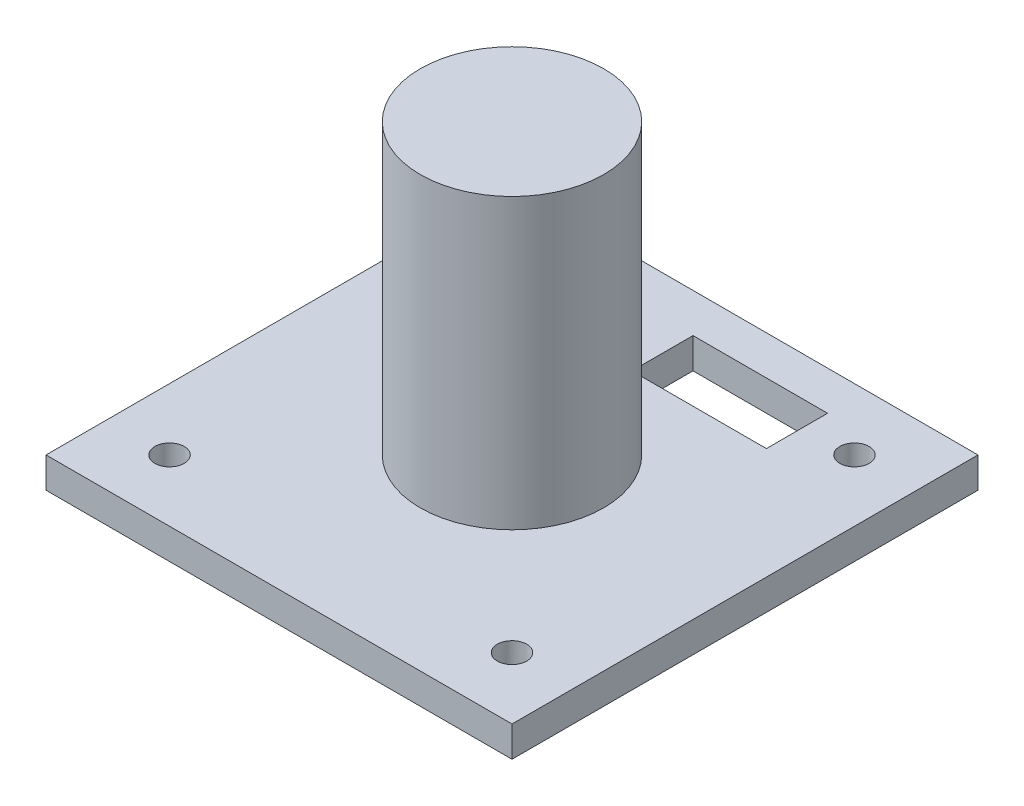
ISO-10303-21;
HEADER;
FILE_DESCRIPTION(('STEP AP214'),'2;1');
FILE_NAME('part.step','',(''),(''),'','','');
FILE_SCHEMA(('AUTOMOTIVE_DESIGN { 1 0 10303 214 1 1 1 1 }'));
ENDSEC;
DATA;
#1=APPLICATION_CONTEXT('core data for automotive mechanical design processes');
#2=APPLICATION_PROTOCOL_DEFINITION('international standard','automotive_design',2000,#1);
#3=PRODUCT_CONTEXT('',#1,'mechanical');
#4=PRODUCT('Part','Part','',(#3));
#5=PRODUCT_RELATED_PRODUCT_CATEGORY('part','',(#4));
#6=PRODUCT_DEFINITION_FORMATION('','',#4);
#7=PRODUCT_DEFINITION_CONTEXT('part definition',#1,'design');
#8=PRODUCT_DEFINITION('design','',#6,#7);
#9=PRODUCT_DEFINITION_SHAPE('','',#8);
#10=(LENGTH_UNIT() NAMED_UNIT(*) SI_UNIT(.MILLI.,.METRE.));
#11=(NAMED_UNIT(*) PLANE_ANGLE_UNIT() SI_UNIT($,.RADIAN.));
#12=(NAMED_UNIT(*) SI_UNIT($,.STERADIAN.) SOLID_ANGLE_UNIT());
#13=UNCERTAINTY_MEASURE_WITH_UNIT(LENGTH_MEASURE(1.E-05),#10,'distance_accuracy_value','');
#14=(GEOMETRIC_REPRESENTATION_CONTEXT(3) GLOBAL_UNCERTAINTY_ASSIGNED_CONTEXT((#13)) GLOBAL_UNIT_ASSIGNED_CONTEXT((#10,
#11,#12)) REPRESENTATION_CONTEXT('',''));
#15=CARTESIAN_POINT('',(0.,0.,0.));
#16=DIRECTION('',(0.,0.,1.));
#17=DIRECTION('',(1.,0.,0.));
#18=AXIS2_PLACEMENT_3D('',#15,#16,#17);
#19=CARTESIAN_POINT('',(0.,2.5,-10.85));
#20=DIRECTION('',(0.,0.,1.));
#21=DIRECTION('',(1.,0.,0.));
#22=AXIS2_PLACEMENT_3D('',#19,#20,#21);
#23=PLANE('',#22);
#24=DIRECTION('',(-1.,0.,0.));
#25=VECTOR('',#24,1.);
#26=CARTESIAN_POINT('',(0.,0.,-10.85));
#27=LINE('',#26,#25);
#28=CARTESIAN_POINT('',(9.95,0.,-10.85));
#29=VERTEX_POINT('',#28);
#30=CARTESIAN_POINT('',(-1.05,0.,-10.85));
#31=VERTEX_POINT('',#30);
#32=EDGE_CURVE('E178',#29,#31,#27,.T.);
#33=ORIENTED_EDGE('',*,*,#32,.T.);
#34=DIRECTION('',(0.,-1.,0.));
#35=VECTOR('',#34,1.);
#36=CARTESIAN_POINT('',(-1.05,2.5,-10.85));
#37=LINE('',#36,#35);
#38=CARTESIAN_POINT('',(-1.05,2.5,-10.85));
#39=VERTEX_POINT('',#38);
#40=EDGE_CURVE('E11',#39,#31,#37,.T.);
#41=ORIENTED_EDGE('',*,*,#40,.F.);
#42=DIRECTION('',(-1.,0.,0.));
#43=VECTOR('',#42,1.);
#44=CARTESIAN_POINT('',(0.,2.5,-10.85));
#45=LINE('',#44,#43);
#46=CARTESIAN_POINT('',(9.95,2.5,-10.85));
#47=VERTEX_POINT('',#46);
#48=EDGE_CURVE('E130',#47,#39,#45,.T.);
#49=ORIENTED_EDGE('',*,*,#48,.F.);
#50=DIRECTION('',(0.,-1.,0.));
#51=VECTOR('',#50,1.);
#52=CARTESIAN_POINT('',(9.95,2.5,-10.85));
#53=LINE('',#52,#51);
#54=EDGE_CURVE('E189',#47,#29,#53,.T.);
#55=ORIENTED_EDGE('',*,*,#54,.T.);
#56=EDGE_LOOP('',(#33,#41,#49,#55));
#57=FACE_BOUND('',#56,.T.);
#58=ADVANCED_FACE('F47',(#57),#23,.F.);
#59=CARTESIAN_POINT('',(-1.05,2.5,0.));
#60=DIRECTION('',(-1.,0.,0.));
#61=DIRECTION('',(0.,0.,1.));
#62=AXIS2_PLACEMENT_3D('',#59,#60,#61);
#63=PLANE('',#62);
#64=DIRECTION('',(0.,0.,-1.));
#65=VECTOR('',#64,1.);
#66=CARTESIAN_POINT('',(-1.05,0.,0.));
#67=LINE('',#66,#65);
#68=CARTESIAN_POINT('',(-1.05,0.,-15.85));
#69=VERTEX_POINT('',#68);
#70=EDGE_CURVE('E136',#31,#69,#67,.T.);
#71=ORIENTED_EDGE('',*,*,#70,.T.);
#72=DIRECTION('',(0.,-1.,0.));
#73=VECTOR('',#72,1.);
#74=CARTESIAN_POINT('',(-1.05,2.5,-15.85));
#75=LINE('',#74,#73);
#76=CARTESIAN_POINT('',(-1.05,2.5,-15.85));
#77=VERTEX_POINT('',#76);
#78=EDGE_CURVE('E58',#77,#69,#75,.T.);
#79=ORIENTED_EDGE('',*,*,#78,.F.);
#80=DIRECTION('',(0.,0.,-1.));
#81=VECTOR('',#80,1.);
#82=CARTESIAN_POINT('',(-1.05,2.5,0.));
#83=LINE('',#82,#81);
#84=EDGE_CURVE('E124',#39,#77,#83,.T.);
#85=ORIENTED_EDGE('',*,*,#84,.F.);
#86=ORIENTED_EDGE('',*,*,#40,.T.);
#87=EDGE_LOOP('',(#71,#79,#85,#86));
#88=FACE_BOUND('',#87,.T.);
#89=ADVANCED_FACE('F135',(#88),#63,.F.);
#90=CARTESIAN_POINT('',(0.,2.5,-15.85));
#91=DIRECTION('',(0.,0.,-1.));
#92=DIRECTION('',(-1.,0.,0.));
#93=AXIS2_PLACEMENT_3D('',#90,#91,#92);
#94=PLANE('',#93);
#95=DIRECTION('',(1.,0.,0.));
#96=VECTOR('',#95,1.);
#97=CARTESIAN_POINT('',(0.,0.,-15.85));
#98=LINE('',#97,#96);
#99=CARTESIAN_POINT('',(9.95,0.,-15.85));
#100=VERTEX_POINT('',#99);
#101=EDGE_CURVE('E96',#69,#100,#98,.T.);
#102=ORIENTED_EDGE('',*,*,#101,.T.);
#103=DIRECTION('',(0.,-1.,0.));
#104=VECTOR('',#103,1.);
#105=CARTESIAN_POINT('',(9.95,2.5,-15.85));
#106=LINE('',#105,#104);
#107=CARTESIAN_POINT('',(9.95,2.5,-15.85));
#108=VERTEX_POINT('',#107);
#109=EDGE_CURVE('E138',#108,#100,#106,.T.);
#110=ORIENTED_EDGE('',*,*,#109,.F.);
#111=DIRECTION('',(1.,0.,0.));
#112=VECTOR('',#111,1.);
#113=CARTESIAN_POINT('',(0.,2.5,-15.85));
#114=LINE('',#113,#112);
#115=EDGE_CURVE('E128',#77,#108,#114,.T.);
#116=ORIENTED_EDGE('',*,*,#115,.F.);
#117=ORIENTED_EDGE('',*,*,#78,.T.);
#118=EDGE_LOOP('',(#102,#110,#116,#117));
#119=FACE_BOUND('',#118,.T.);
#120=ADVANCED_FACE('F140',(#119),#94,.F.);
#121=CARTESIAN_POINT('',(19.05,2.5,0.));
#122=DIRECTION('',(-1.,0.,0.));
#123=DIRECTION('',(0.,0.,1.));
#124=AXIS2_PLACEMENT_3D('',#121,#122,#123);
#125=PLANE('',#124);
#126=DIRECTION('',(0.,0.,-1.));
#127=VECTOR('',#126,1.);
#128=CARTESIAN_POINT('',(19.05,0.,0.));
#129=LINE('',#128,#127);
#130=CARTESIAN_POINT('',(19.05,0.,19.05));
#131=VERTEX_POINT('',#130);
#132=CARTESIAN_POINT('',(19.05,0.,-19.05));
#133=VERTEX_POINT('',#132);
#134=EDGE_CURVE('E165',#131,#133,#129,.T.);
#135=ORIENTED_EDGE('',*,*,#134,.T.);
#136=DIRECTION('',(0.,-1.,0.));
#137=VECTOR('',#136,1.);
#138=CARTESIAN_POINT('',(19.05,2.5,-19.05));
#139=LINE('',#138,#137);
#140=CARTESIAN_POINT('',(19.05,2.5,-19.05));
#141=VERTEX_POINT('',#140);
#142=EDGE_CURVE('E51',#141,#133,#139,.T.);
#143=ORIENTED_EDGE('',*,*,#142,.F.);
#144=DIRECTION('',(0.,0.,-1.));
#145=VECTOR('',#144,1.);
#146=CARTESIAN_POINT('',(19.05,2.5,0.));
#147=LINE('',#146,#145);
#148=CARTESIAN_POINT('',(19.05,2.5,19.05));
#149=VERTEX_POINT('',#148);
#150=EDGE_CURVE('E234',#149,#141,#147,.T.);
#151=ORIENTED_EDGE('',*,*,#150,.F.);
#152=DIRECTION('',(0.,-1.,0.));
#153=VECTOR('',#152,1.);
#154=CARTESIAN_POINT('',(19.05,2.5,19.05));
#155=LINE('',#154,#153);
#156=EDGE_CURVE('E144',#149,#131,#155,.T.);
#157=ORIENTED_EDGE('',*,*,#156,.T.);
#158=EDGE_LOOP('',(#135,#143,#151,#157));
#159=FACE_BOUND('',#158,.T.);
#160=ADVANCED_FACE('F212',(#159),#125,.F.);
#161=CARTESIAN_POINT('',(0.,2.5,-19.05));
#162=DIRECTION('',(0.,0.,1.));
#163=DIRECTION('',(1.,0.,0.));
#164=AXIS2_PLACEMENT_3D('',#161,#162,#163);
#165=PLANE('',#164);
#166=DIRECTION('',(-1.,0.,0.));
#167=VECTOR('',#166,1.);
#168=CARTESIAN_POINT('',(0.,0.,-19.05));
#169=LINE('',#168,#167);
#170=CARTESIAN_POINT('',(-19.05,0.,-19.05));
#171=VERTEX_POINT('',#170);
#172=EDGE_CURVE('E169',#133,#171,#169,.T.);
#173=ORIENTED_EDGE('',*,*,#172,.T.);
#174=DIRECTION('',(0.,-1.,0.));
#175=VECTOR('',#174,1.);
#176=CARTESIAN_POINT('',(-19.05,2.5,-19.05));
#177=LINE('',#176,#175);
#178=CARTESIAN_POINT('',(-19.05,2.5,-19.05));
#179=VERTEX_POINT('',#178);
#180=EDGE_CURVE('E200',#179,#171,#177,.T.);
#181=ORIENTED_EDGE('',*,*,#180,.F.);
#182=DIRECTION('',(-1.,0.,0.));
#183=VECTOR('',#182,1.);
#184=CARTESIAN_POINT('',(0.,2.5,-19.05));
#185=LINE('',#184,#183);
#186=EDGE_CURVE('E111',#141,#179,#185,.T.);
#187=ORIENTED_EDGE('',*,*,#186,.F.);
#188=ORIENTED_EDGE('',*,*,#142,.T.);
#189=EDGE_LOOP('',(#173,#181,#187,#188));
#190=FACE_BOUND('',#189,.T.);
#191=ADVANCED_FACE('F208',(#190),#165,.F.);
#192=CARTESIAN_POINT('',(-19.05,2.5,0.));
#193=DIRECTION('',(1.,0.,0.));
#194=DIRECTION('',(0.,0.,-1.));
#195=AXIS2_PLACEMENT_3D('',#192,#193,#194);
#196=PLANE('',#195);
#197=DIRECTION('',(0.,0.,1.));
#198=VECTOR('',#197,1.);
#199=CARTESIAN_POINT('',(-19.05,0.,0.));
#200=LINE('',#199,#198);
#201=CARTESIAN_POINT('',(-19.05,0.,19.05));
#202=VERTEX_POINT('',#201);
#203=EDGE_CURVE('E172',#171,#202,#200,.T.);
#204=ORIENTED_EDGE('',*,*,#203,.T.);
#205=DIRECTION('',(0.,-1.,0.));
#206=VECTOR('',#205,1.);
#207=CARTESIAN_POINT('',(-19.05,2.5,19.05));
#208=LINE('',#207,#206);
#209=CARTESIAN_POINT('',(-19.05,2.5,19.05));
#210=VERTEX_POINT('',#209);
#211=EDGE_CURVE('E197',#210,#202,#208,.T.);
#212=ORIENTED_EDGE('',*,*,#211,.F.);
#213=DIRECTION('',(0.,0.,1.));
#214=VECTOR('',#213,1.);
#215=CARTESIAN_POINT('',(-19.05,2.5,0.));
#216=LINE('',#215,#214);
#217=EDGE_CURVE('E226',#179,#210,#216,.T.);
#218=ORIENTED_EDGE('',*,*,#217,.F.);
#219=ORIENTED_EDGE('',*,*,#180,.T.);
#220=EDGE_LOOP('',(#204,#212,#218,#219));
#221=FACE_BOUND('',#220,.T.);
#222=ADVANCED_FACE('F219',(#221),#196,.F.);
#223=CARTESIAN_POINT('',(0.,2.5,19.05));
#224=DIRECTION('',(0.,0.,-1.));
#225=DIRECTION('',(-1.,0.,0.));
#226=AXIS2_PLACEMENT_3D('',#223,#224,#225);
#227=PLANE('',#226);
#228=DIRECTION('',(1.,0.,0.));
#229=VECTOR('',#228,1.);
#230=CARTESIAN_POINT('',(0.,0.,19.05));
#231=LINE('',#230,#229);
#232=EDGE_CURVE('E175',#202,#131,#231,.T.);
#233=ORIENTED_EDGE('',*,*,#232,.T.);
#234=ORIENTED_EDGE('',*,*,#156,.F.);
#235=DIRECTION('',(1.,0.,0.));
#236=VECTOR('',#235,1.);
#237=CARTESIAN_POINT('',(0.,2.5,19.05));
#238=LINE('',#237,#236);
#239=EDGE_CURVE('E223',#210,#149,#238,.T.);
#240=ORIENTED_EDGE('',*,*,#239,.F.);
#241=ORIENTED_EDGE('',*,*,#211,.T.);
#242=EDGE_LOOP('',(#233,#234,#240,#241));
#243=FACE_BOUND('',#242,.T.);
#244=ADVANCED_FACE('F222',(#243),#227,.F.);
#245=CARTESIAN_POINT('',(-14.,2.5,-14.));
#246=DIRECTION('',(0.,-1.,0.));
#247=DIRECTION('',(0.,0.,-1.));
#248=AXIS2_PLACEMENT_3D('',#245,#246,#247);
#249=CYLINDRICAL_SURFACE('',#248,1.2);
#250=CARTESIAN_POINT('',(-14.,2.5,-14.));
#251=DIRECTION('',(0.,1.,0.));
#252=DIRECTION('',(0.,0.,1.));
#253=AXIS2_PLACEMENT_3D('',#250,#251,#252);
#254=CIRCLE('',#253,1.2);
#255=CARTESIAN_POINT('',(-14.,2.5,-12.8));
#256=VERTEX_POINT('',#255);
#257=EDGE_CURVE('E241',#256,#256,#254,.T.);
#258=ORIENTED_EDGE('',*,*,#257,.T.);
#259=EDGE_LOOP('',(#258));
#260=FACE_BOUND('',#259,.T.);
#261=CARTESIAN_POINT('',(-14.,0.,-14.));
#262=DIRECTION('',(0.,1.,0.));
#263=DIRECTION('',(0.,0.,1.));
#264=AXIS2_PLACEMENT_3D('',#261,#262,#263);
#265=CIRCLE('',#264,1.2);
#266=CARTESIAN_POINT('',(-14.,0.,-12.8));
#267=VERTEX_POINT('',#266);
#268=EDGE_CURVE('E161',#267,#267,#265,.T.);
#269=ORIENTED_EDGE('',*,*,#268,.F.);
#270=EDGE_LOOP('',(#269));
#271=FACE_BOUND('',#270,.T.);
#272=ADVANCED_FACE('F285',(#260,#271),#249,.F.);
#273=CARTESIAN_POINT('',(14.,2.5,-14.));
#274=DIRECTION('',(0.,-1.,0.));
#275=DIRECTION('',(0.,0.,-1.));
#276=AXIS2_PLACEMENT_3D('',#273,#274,#275);
#277=CYLINDRICAL_SURFACE('',#276,1.2);
#278=CARTESIAN_POINT('',(14.,2.5,-14.));
#279=DIRECTION('',(0.,1.,0.));
#280=DIRECTION('',(0.,0.,1.));
#281=AXIS2_PLACEMENT_3D('',#278,#279,#280);
#282=CIRCLE('',#281,1.2);
#283=CARTESIAN_POINT('',(14.,2.5,-12.8));
#284=VERTEX_POINT('',#283);
#285=EDGE_CURVE('E245',#284,#284,#282,.T.);
#286=ORIENTED_EDGE('',*,*,#285,.T.);
#287=EDGE_LOOP('',(#286));
#288=FACE_BOUND('',#287,.T.);
#289=CARTESIAN_POINT('',(14.,0.,-14.));
#290=DIRECTION('',(0.,1.,0.));
#291=DIRECTION('',(0.,0.,1.));
#292=AXIS2_PLACEMENT_3D('',#289,#290,#291);
#293=CIRCLE('',#292,1.2);
#294=CARTESIAN_POINT('',(14.,0.,-12.8));
#295=VERTEX_POINT('',#294);
#296=EDGE_CURVE('E157',#295,#295,#293,.T.);
#297=ORIENTED_EDGE('',*,*,#296,.F.);
#298=EDGE_LOOP('',(#297));
#299=FACE_BOUND('',#298,.T.);
#300=ADVANCED_FACE('F294',(#288,#299),#277,.F.);
#301=CARTESIAN_POINT('',(14.,2.5,14.));
#302=DIRECTION('',(0.,-1.,0.));
#303=DIRECTION('',(0.,0.,-1.));
#304=AXIS2_PLACEMENT_3D('',#301,#302,#303);
#305=CYLINDRICAL_SURFACE('',#304,1.2);
#306=CARTESIAN_POINT('',(14.,2.5,14.));
#307=DIRECTION('',(0.,1.,0.));
#308=DIRECTION('',(0.,0.,1.));
#309=AXIS2_PLACEMENT_3D('',#306,#307,#308);
#310=CIRCLE('',#309,1.2);
#311=CARTESIAN_POINT('',(14.,2.5,15.2));
#312=VERTEX_POINT('',#311);
#313=EDGE_CURVE('E249',#312,#312,#310,.T.);
#314=ORIENTED_EDGE('',*,*,#313,.T.);
#315=EDGE_LOOP('',(#314));
#316=FACE_BOUND('',#315,.T.);
#317=CARTESIAN_POINT('',(14.,0.,14.));
#318=DIRECTION('',(0.,1.,0.));
#319=DIRECTION('',(0.,0.,1.));
#320=AXIS2_PLACEMENT_3D('',#317,#318,#319);
#321=CIRCLE('',#320,1.2);
#322=CARTESIAN_POINT('',(14.,0.,15.2));
#323=VERTEX_POINT('',#322);
#324=EDGE_CURVE('E152',#323,#323,#321,.T.);
#325=ORIENTED_EDGE('',*,*,#324,.F.);
#326=EDGE_LOOP('',(#325));
#327=FACE_BOUND('',#326,.T.);
#328=ADVANCED_FACE('F297',(#316,#327),#305,.F.);
#329=CARTESIAN_POINT('',(-14.,2.5,14.));
#330=DIRECTION('',(0.,-1.,0.));
#331=DIRECTION('',(0.,0.,-1.));
#332=AXIS2_PLACEMENT_3D('',#329,#330,#331);
#333=CYLINDRICAL_SURFACE('',#332,1.2);
#334=CARTESIAN_POINT('',(-14.,2.5,14.));
#335=DIRECTION('',(0.,1.,0.));
#336=DIRECTION('',(0.,0.,1.));
#337=AXIS2_PLACEMENT_3D('',#334,#335,#336);
#338=CIRCLE('',#337,1.2);
#339=CARTESIAN_POINT('',(-14.,2.5,15.2));
#340=VERTEX_POINT('',#339);
#341=EDGE_CURVE('E188',#340,#340,#338,.T.);
#342=ORIENTED_EDGE('',*,*,#341,.T.);
#343=EDGE_LOOP('',(#342));
#344=FACE_BOUND('',#343,.T.);
#345=CARTESIAN_POINT('',(-14.,0.,14.));
#346=DIRECTION('',(0.,1.,0.));
#347=DIRECTION('',(0.,0.,1.));
#348=AXIS2_PLACEMENT_3D('',#345,#346,#347);
#349=CIRCLE('',#348,1.2);
#350=CARTESIAN_POINT('',(-14.,0.,15.2));
#351=VERTEX_POINT('',#350);
#352=EDGE_CURVE('E148',#351,#351,#349,.T.);
#353=ORIENTED_EDGE('',*,*,#352,.F.);
#354=EDGE_LOOP('',(#353));
#355=FACE_BOUND('',#354,.T.);
#356=ADVANCED_FACE('F49',(#344,#355),#333,.F.);
#357=CARTESIAN_POINT('',(9.95000000000001,2.5,0.));
#358=DIRECTION('',(1.,0.,0.));
#359=DIRECTION('',(0.,0.,-1.));
#360=AXIS2_PLACEMENT_3D('',#357,#358,#359);
#361=PLANE('',#360);
#362=DIRECTION('',(0.,0.,1.));
#363=VECTOR('',#362,1.);
#364=CARTESIAN_POINT('',(9.95000000000001,0.,0.));
#365=LINE('',#364,#363);
#366=EDGE_CURVE('E102',#100,#29,#365,.T.);
#367=ORIENTED_EDGE('',*,*,#366,.T.);
#368=ORIENTED_EDGE('',*,*,#54,.F.);
#369=DIRECTION('',(0.,0.,1.));
#370=VECTOR('',#369,1.);
#371=CARTESIAN_POINT('',(9.95000000000001,2.5,0.));
#372=LINE('',#371,#370);
#373=EDGE_CURVE('E67',#108,#47,#372,.T.);
#374=ORIENTED_EDGE('',*,*,#373,.F.);
#375=ORIENTED_EDGE('',*,*,#109,.T.);
#376=EDGE_LOOP('',(#367,#368,#374,#375));
#377=FACE_BOUND('',#376,.T.);
#378=ADVANCED_FACE('F304',(#377),#361,.F.);
#379=CARTESIAN_POINT('',(0.,2.5,0.));
#380=DIRECTION('',(0.,1.,0.));
#381=DIRECTION('',(0.,0.,1.));
#382=AXIS2_PLACEMENT_3D('',#379,#380,#381);
#383=PLANE('',#382);
#384=ORIENTED_EDGE('',*,*,#341,.F.);
#385=EDGE_LOOP('',(#384));
#386=FACE_BOUND('',#385,.T.);
#387=ORIENTED_EDGE('',*,*,#313,.F.);
#388=EDGE_LOOP('',(#387));
#389=FACE_BOUND('',#388,.T.);
#390=ORIENTED_EDGE('',*,*,#285,.F.);
#391=EDGE_LOOP('',(#390));
#392=FACE_BOUND('',#391,.T.);
#393=ORIENTED_EDGE('',*,*,#257,.F.);
#394=EDGE_LOOP('',(#393));
#395=FACE_BOUND('',#394,.T.);
#396=CARTESIAN_POINT('',(0.,2.5,0.));
#397=DIRECTION('',(0.,1.,0.));
#398=DIRECTION('',(0.,0.,1.));
#399=AXIS2_PLACEMENT_3D('',#396,#397,#398);
#400=CIRCLE('',#399,7.5);
#401=CARTESIAN_POINT('',(0.,2.5,7.5));
#402=VERTEX_POINT('',#401);
#403=EDGE_CURVE('E237',#402,#402,#400,.T.);
#404=ORIENTED_EDGE('',*,*,#403,.F.);
#405=EDGE_LOOP('',(#404));
#406=FACE_BOUND('',#405,.T.);
#407=ORIENTED_EDGE('',*,*,#150,.T.);
#408=ORIENTED_EDGE('',*,*,#186,.T.);
#409=ORIENTED_EDGE('',*,*,#217,.T.);
#410=ORIENTED_EDGE('',*,*,#239,.T.);
#411=EDGE_LOOP('',(#407,#408,#409,#410));
#412=FACE_BOUND('',#411,.T.);
#413=ORIENTED_EDGE('',*,*,#48,.T.);
#414=ORIENTED_EDGE('',*,*,#84,.T.);
#415=ORIENTED_EDGE('',*,*,#115,.T.);
#416=ORIENTED_EDGE('',*,*,#373,.T.);
#417=EDGE_LOOP('',(#413,#414,#415,#416));
#418=FACE_BOUND('',#417,.T.);
#419=ADVANCED_FACE('F126',(#386,#389,#392,#395,#406,#412,#418),#383,.T.);
#420=CARTESIAN_POINT('',(0.,0.,0.));
#421=DIRECTION('',(0.,1.,0.));
#422=DIRECTION('',(0.,0.,1.));
#423=AXIS2_PLACEMENT_3D('',#420,#421,#422);
#424=PLANE('',#423);
#425=ORIENTED_EDGE('',*,*,#352,.T.);
#426=EDGE_LOOP('',(#425));
#427=FACE_BOUND('',#426,.T.);
#428=ORIENTED_EDGE('',*,*,#324,.T.);
#429=EDGE_LOOP('',(#428));
#430=FACE_BOUND('',#429,.T.);
#431=ORIENTED_EDGE('',*,*,#296,.T.);
#432=EDGE_LOOP('',(#431));
#433=FACE_BOUND('',#432,.T.);
#434=ORIENTED_EDGE('',*,*,#268,.T.);
#435=EDGE_LOOP('',(#434));
#436=FACE_BOUND('',#435,.T.);
#437=ORIENTED_EDGE('',*,*,#134,.F.);
#438=ORIENTED_EDGE('',*,*,#232,.F.);
#439=ORIENTED_EDGE('',*,*,#203,.F.);
#440=ORIENTED_EDGE('',*,*,#172,.F.);
#441=EDGE_LOOP('',(#437,#438,#439,#440));
#442=FACE_BOUND('',#441,.T.);
#443=ORIENTED_EDGE('',*,*,#32,.F.);
#444=ORIENTED_EDGE('',*,*,#366,.F.);
#445=ORIENTED_EDGE('',*,*,#101,.F.);
#446=ORIENTED_EDGE('',*,*,#70,.F.);
#447=EDGE_LOOP('',(#443,#444,#445,#446));
#448=FACE_BOUND('',#447,.T.);
#449=ADVANCED_FACE('F216',(#427,#430,#433,#436,#442,#448),#424,.F.);
#450=CARTESIAN_POINT('',(0.,26.1,0.));
#451=DIRECTION('',(0.,-1.,0.));
#452=DIRECTION('',(0.,0.,-1.));
#453=AXIS2_PLACEMENT_3D('',#450,#451,#452);
#454=CYLINDRICAL_SURFACE('',#453,7.5);
#455=ORIENTED_EDGE('',*,*,#403,.T.);
#456=EDGE_LOOP('',(#455));
#457=FACE_BOUND('',#456,.T.);
#458=CARTESIAN_POINT('',(0.,26.1,0.));
#459=DIRECTION('',(0.,1.,0.));
#460=DIRECTION('',(0.,0.,1.));
#461=AXIS2_PLACEMENT_3D('',#458,#459,#460);
#462=CIRCLE('',#461,7.5);
#463=CARTESIAN_POINT('',(0.,26.1,7.5));
#464=VERTEX_POINT('',#463);
#465=EDGE_CURVE('E153',#464,#464,#462,.T.);
#466=ORIENTED_EDGE('',*,*,#465,.F.);
#467=EDGE_LOOP('',(#466));
#468=FACE_BOUND('',#467,.T.);
#469=ADVANCED_FACE('F262',(#457,#468),#454,.T.);
#470=CARTESIAN_POINT('',(0.,26.1,0.));
#471=DIRECTION('',(0.,1.,0.));
#472=DIRECTION('',(0.,0.,1.));
#473=AXIS2_PLACEMENT_3D('',#470,#471,#472);
#474=PLANE('',#473);
#475=ORIENTED_EDGE('',*,*,#465,.T.);
#476=EDGE_LOOP('',(#475));
#477=FACE_BOUND('',#476,.T.);
#478=ADVANCED_FACE('F260',(#477),#474,.T.);
#479=CLOSED_SHELL('',(#58,#89,#120,#160,#191,#222,#244,#272,#300,#328,#356,#378,#419,#449,#469,#478));
#480=MANIFOLD_SOLID_BREP('B2',#479);
#481=ADVANCED_BREP_SHAPE_REPRESENTATION('',(#18,#480),#14);
#482=SHAPE_DEFINITION_REPRESENTATION(#9,#481);
ENDSEC;
END-ISO-10303-21;
